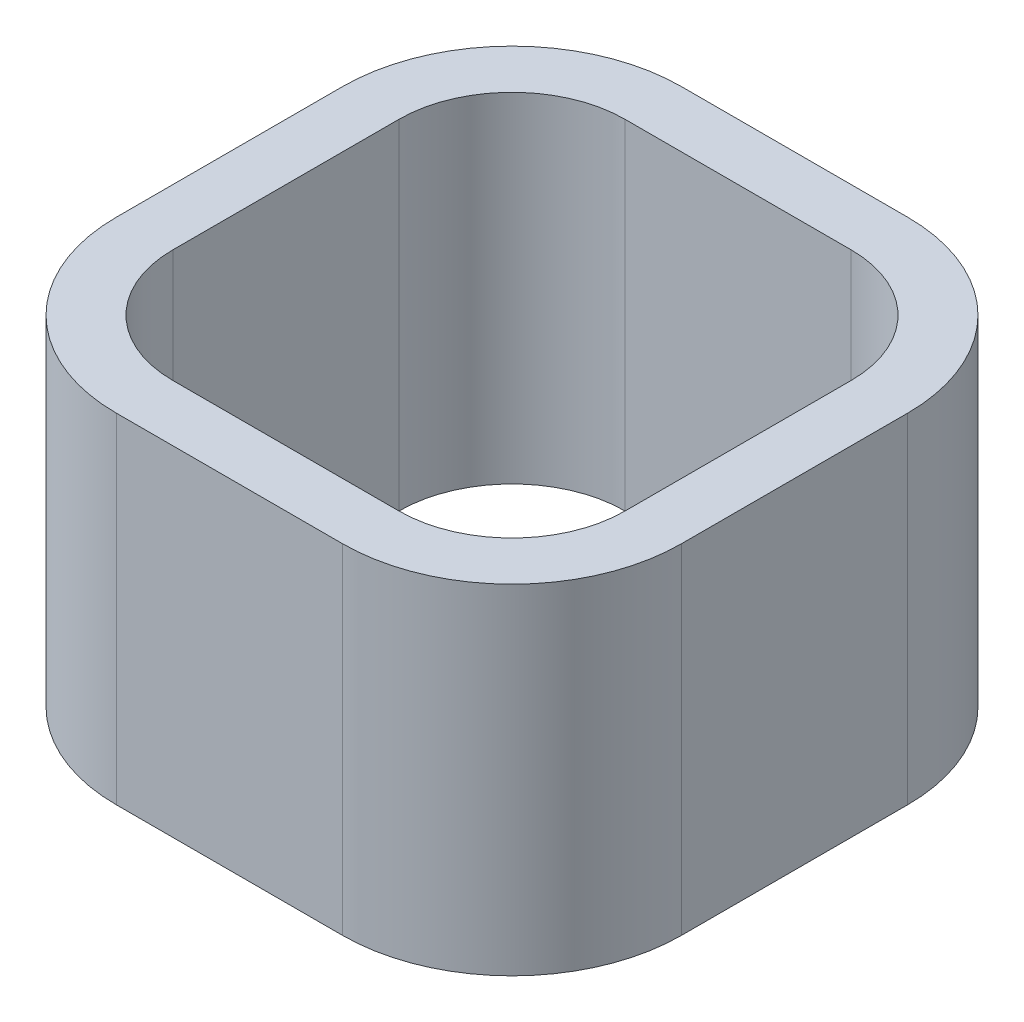
ISO-10303-21;
HEADER;
FILE_DESCRIPTION(('STEP AP214'),'2;1');
FILE_NAME('part.step','',(''),(''),'','','');
FILE_SCHEMA(('AUTOMOTIVE_DESIGN { 1 0 10303 214 1 1 1 1 }'));
ENDSEC;
DATA;
#1=APPLICATION_CONTEXT('core data for automotive mechanical design processes');
#2=APPLICATION_PROTOCOL_DEFINITION('international standard','automotive_design',2000,#1);
#3=PRODUCT_CONTEXT('',#1,'mechanical');
#4=PRODUCT('Part','Part','',(#3));
#5=PRODUCT_RELATED_PRODUCT_CATEGORY('part','',(#4));
#6=PRODUCT_DEFINITION_FORMATION('','',#4);
#7=PRODUCT_DEFINITION_CONTEXT('part definition',#1,'design');
#8=PRODUCT_DEFINITION('design','',#6,#7);
#9=PRODUCT_DEFINITION_SHAPE('','',#8);
#10=(LENGTH_UNIT() NAMED_UNIT(*) SI_UNIT(.MILLI.,.METRE.));
#11=(NAMED_UNIT(*) PLANE_ANGLE_UNIT() SI_UNIT($,.RADIAN.));
#12=(NAMED_UNIT(*) SI_UNIT($,.STERADIAN.) SOLID_ANGLE_UNIT());
#13=UNCERTAINTY_MEASURE_WITH_UNIT(LENGTH_MEASURE(1.E-05),#10,'distance_accuracy_value','');
#14=(GEOMETRIC_REPRESENTATION_CONTEXT(3) GLOBAL_UNCERTAINTY_ASSIGNED_CONTEXT((#13)) GLOBAL_UNIT_ASSIGNED_CONTEXT((#10,
#11,#12)) REPRESENTATION_CONTEXT('',''));
#15=CARTESIAN_POINT('',(0.,0.,0.));
#16=DIRECTION('',(0.,0.,1.));
#17=DIRECTION('',(1.,0.,0.));
#18=AXIS2_PLACEMENT_3D('',#15,#16,#17);
#19=CARTESIAN_POINT('',(0.,3.,0.));
#20=DIRECTION('',(0.,1.,0.));
#21=DIRECTION('',(0.,0.,1.));
#22=AXIS2_PLACEMENT_3D('',#19,#20,#21);
#23=PLANE('',#22);
#24=DIRECTION('',(1.,0.,0.));
#25=VECTOR('',#24,1.);
#26=CARTESIAN_POINT('',(-2.5,3.,2.5));
#27=LINE('',#26,#25);
#28=CARTESIAN_POINT('',(-1.,3.,2.5));
#29=VERTEX_POINT('',#28);
#30=CARTESIAN_POINT('',(1.,3.,2.5));
#31=VERTEX_POINT('',#30);
#32=EDGE_CURVE('E200',#29,#31,#27,.T.);
#33=ORIENTED_EDGE('',*,*,#32,.T.);
#34=CARTESIAN_POINT('',(1.,3.,1.));
#35=DIRECTION('',(0.,1.,0.));
#36=DIRECTION('',(0.,0.,1.));
#37=AXIS2_PLACEMENT_3D('',#34,#35,#36);
#38=CIRCLE('',#37,1.5);
#39=CARTESIAN_POINT('',(2.5,3.,1.));
#40=VERTEX_POINT('',#39);
#41=EDGE_CURVE('E271',#31,#40,#38,.T.);
#42=ORIENTED_EDGE('',*,*,#41,.T.);
#43=DIRECTION('',(0.,0.,-1.));
#44=VECTOR('',#43,1.);
#45=CARTESIAN_POINT('',(2.5,3.,-2.5));
#46=LINE('',#45,#44);
#47=CARTESIAN_POINT('',(2.5,3.,-0.999999999999999));
#48=VERTEX_POINT('',#47);
#49=EDGE_CURVE('E192',#40,#48,#46,.T.);
#50=ORIENTED_EDGE('',*,*,#49,.T.);
#51=CARTESIAN_POINT('',(1.,3.,-0.999999999999999));
#52=DIRECTION('',(0.,1.,0.));
#53=DIRECTION('',(0.,0.,1.));
#54=AXIS2_PLACEMENT_3D('',#51,#52,#53);
#55=CIRCLE('',#54,1.5);
#56=CARTESIAN_POINT('',(1.,3.,-2.5));
#57=VERTEX_POINT('',#56);
#58=EDGE_CURVE('E266',#48,#57,#55,.T.);
#59=ORIENTED_EDGE('',*,*,#58,.T.);
#60=DIRECTION('',(-1.,0.,0.));
#61=VECTOR('',#60,1.);
#62=CARTESIAN_POINT('',(-2.5,3.,-2.5));
#63=LINE('',#62,#61);
#64=CARTESIAN_POINT('',(-1.,3.,-2.5));
#65=VERTEX_POINT('',#64);
#66=EDGE_CURVE('E195',#57,#65,#63,.T.);
#67=ORIENTED_EDGE('',*,*,#66,.T.);
#68=CARTESIAN_POINT('',(-1.,3.,-0.999999999999999));
#69=DIRECTION('',(0.,1.,0.));
#70=DIRECTION('',(0.,0.,1.));
#71=AXIS2_PLACEMENT_3D('',#68,#69,#70);
#72=CIRCLE('',#71,1.5);
#73=CARTESIAN_POINT('',(-2.5,3.,-0.999999999999999));
#74=VERTEX_POINT('',#73);
#75=EDGE_CURVE('E62',#65,#74,#72,.T.);
#76=ORIENTED_EDGE('',*,*,#75,.T.);
#77=DIRECTION('',(0.,0.,1.));
#78=VECTOR('',#77,1.);
#79=CARTESIAN_POINT('',(-2.5,3.,-2.5));
#80=LINE('',#79,#78);
#81=CARTESIAN_POINT('',(-2.5,3.,1.));
#82=VERTEX_POINT('',#81);
#83=EDGE_CURVE('E198',#74,#82,#80,.T.);
#84=ORIENTED_EDGE('',*,*,#83,.T.);
#85=CARTESIAN_POINT('',(-1.,3.,1.));
#86=DIRECTION('',(0.,1.,0.));
#87=DIRECTION('',(0.,0.,1.));
#88=AXIS2_PLACEMENT_3D('',#85,#86,#87);
#89=CIRCLE('',#88,1.5);
#90=EDGE_CURVE('E269',#82,#29,#89,.T.);
#91=ORIENTED_EDGE('',*,*,#90,.T.);
#92=EDGE_LOOP('',(#33,#42,#50,#59,#67,#76,#84,#91));
#93=FACE_BOUND('',#92,.T.);
#94=DIRECTION('',(-1.,0.,0.));
#95=VECTOR('',#94,1.);
#96=CARTESIAN_POINT('',(-2.,3.,-2.));
#97=LINE('',#96,#95);
#98=CARTESIAN_POINT('',(1.,3.,-2.));
#99=VERTEX_POINT('',#98);
#100=CARTESIAN_POINT('',(-1.,3.,-2.));
#101=VERTEX_POINT('',#100);
#102=EDGE_CURVE('E174',#99,#101,#97,.T.);
#103=ORIENTED_EDGE('',*,*,#102,.F.);
#104=CARTESIAN_POINT('',(1.,3.,-1.));
#105=DIRECTION('',(0.,1.,0.));
#106=DIRECTION('',(0.,0.,1.));
#107=AXIS2_PLACEMENT_3D('',#104,#105,#106);
#108=CIRCLE('',#107,1.);
#109=CARTESIAN_POINT('',(2.,3.,-1.));
#110=VERTEX_POINT('',#109);
#111=EDGE_CURVE('E242',#99,#110,#108,.F.);
#112=ORIENTED_EDGE('',*,*,#111,.T.);
#113=DIRECTION('',(0.,0.,-1.));
#114=VECTOR('',#113,1.);
#115=CARTESIAN_POINT('',(2.,3.,-2.));
#116=LINE('',#115,#114);
#117=CARTESIAN_POINT('',(2.,3.,1.));
#118=VERTEX_POINT('',#117);
#119=EDGE_CURVE('E171',#118,#110,#116,.T.);
#120=ORIENTED_EDGE('',*,*,#119,.F.);
#121=CARTESIAN_POINT('',(1.,3.,1.));
#122=DIRECTION('',(0.,1.,0.));
#123=DIRECTION('',(0.,0.,1.));
#124=AXIS2_PLACEMENT_3D('',#121,#122,#123);
#125=CIRCLE('',#124,1.);
#126=CARTESIAN_POINT('',(1.,3.,2.));
#127=VERTEX_POINT('',#126);
#128=EDGE_CURVE('E238',#118,#127,#125,.F.);
#129=ORIENTED_EDGE('',*,*,#128,.T.);
#130=DIRECTION('',(1.,0.,0.));
#131=VECTOR('',#130,1.);
#132=CARTESIAN_POINT('',(-2.,3.,2.));
#133=LINE('',#132,#131);
#134=CARTESIAN_POINT('',(-0.999999999999999,3.,2.));
#135=VERTEX_POINT('',#134);
#136=EDGE_CURVE('E181',#135,#127,#133,.T.);
#137=ORIENTED_EDGE('',*,*,#136,.F.);
#138=CARTESIAN_POINT('',(-0.999999999999999,3.,1.));
#139=DIRECTION('',(0.,1.,0.));
#140=DIRECTION('',(0.,0.,1.));
#141=AXIS2_PLACEMENT_3D('',#138,#139,#140);
#142=CIRCLE('',#141,1.);
#143=CARTESIAN_POINT('',(-2.,3.,1.));
#144=VERTEX_POINT('',#143);
#145=EDGE_CURVE('E234',#135,#144,#142,.F.);
#146=ORIENTED_EDGE('',*,*,#145,.T.);
#147=DIRECTION('',(0.,0.,1.));
#148=VECTOR('',#147,1.);
#149=CARTESIAN_POINT('',(-2.,3.,-2.));
#150=LINE('',#149,#148);
#151=CARTESIAN_POINT('',(-2.,3.,-0.999999999999999));
#152=VERTEX_POINT('',#151);
#153=EDGE_CURVE('E178',#152,#144,#150,.T.);
#154=ORIENTED_EDGE('',*,*,#153,.F.);
#155=CARTESIAN_POINT('',(-1.,3.,-1.));
#156=DIRECTION('',(0.,1.,0.));
#157=DIRECTION('',(0.,0.,1.));
#158=AXIS2_PLACEMENT_3D('',#155,#156,#157);
#159=CIRCLE('',#158,1.);
#160=EDGE_CURVE('E246',#152,#101,#159,.F.);
#161=ORIENTED_EDGE('',*,*,#160,.T.);
#162=EDGE_LOOP('',(#103,#112,#120,#129,#137,#146,#154,#161));
#163=FACE_BOUND('',#162,.T.);
#164=ADVANCED_FACE('F36',(#93,#163),#23,.T.);
#165=CARTESIAN_POINT('',(0.,0.,0.));
#166=DIRECTION('',(0.,1.,0.));
#167=DIRECTION('',(0.,0.,1.));
#168=AXIS2_PLACEMENT_3D('',#165,#166,#167);
#169=PLANE('',#168);
#170=DIRECTION('',(0.,0.,-1.));
#171=VECTOR('',#170,1.);
#172=CARTESIAN_POINT('',(2.5,0.,-2.5));
#173=LINE('',#172,#171);
#174=CARTESIAN_POINT('',(2.5,0.,1.));
#175=VERTEX_POINT('',#174);
#176=CARTESIAN_POINT('',(2.5,0.,-0.999999999999999));
#177=VERTEX_POINT('',#176);
#178=EDGE_CURVE('E183',#175,#177,#173,.T.);
#179=ORIENTED_EDGE('',*,*,#178,.F.);
#180=CARTESIAN_POINT('',(1.,0.,1.));
#181=DIRECTION('',(0.,1.,0.));
#182=DIRECTION('',(0.,0.,1.));
#183=AXIS2_PLACEMENT_3D('',#180,#181,#182);
#184=CIRCLE('',#183,1.5);
#185=CARTESIAN_POINT('',(1.,0.,2.5));
#186=VERTEX_POINT('',#185);
#187=EDGE_CURVE('E259',#175,#186,#184,.F.);
#188=ORIENTED_EDGE('',*,*,#187,.T.);
#189=DIRECTION('',(1.,0.,0.));
#190=VECTOR('',#189,1.);
#191=CARTESIAN_POINT('',(-2.5,0.,2.5));
#192=LINE('',#191,#190);
#193=CARTESIAN_POINT('',(-1.,0.,2.5));
#194=VERTEX_POINT('',#193);
#195=EDGE_CURVE('E196',#194,#186,#192,.T.);
#196=ORIENTED_EDGE('',*,*,#195,.F.);
#197=CARTESIAN_POINT('',(-1.,0.,1.));
#198=DIRECTION('',(0.,1.,0.));
#199=DIRECTION('',(0.,0.,1.));
#200=AXIS2_PLACEMENT_3D('',#197,#198,#199);
#201=CIRCLE('',#200,1.5);
#202=CARTESIAN_POINT('',(-2.5,0.,1.));
#203=VERTEX_POINT('',#202);
#204=EDGE_CURVE('E257',#194,#203,#201,.F.);
#205=ORIENTED_EDGE('',*,*,#204,.T.);
#206=DIRECTION('',(0.,0.,1.));
#207=VECTOR('',#206,1.);
#208=CARTESIAN_POINT('',(-2.5,0.,-2.5));
#209=LINE('',#208,#207);
#210=CARTESIAN_POINT('',(-2.5,0.,-0.999999999999999));
#211=VERTEX_POINT('',#210);
#212=EDGE_CURVE('E209',#211,#203,#209,.T.);
#213=ORIENTED_EDGE('',*,*,#212,.F.);
#214=CARTESIAN_POINT('',(-1.,0.,-0.999999999999999));
#215=DIRECTION('',(0.,1.,0.));
#216=DIRECTION('',(0.,0.,1.));
#217=AXIS2_PLACEMENT_3D('',#214,#215,#216);
#218=CIRCLE('',#217,1.5);
#219=CARTESIAN_POINT('',(-1.,0.,-2.5));
#220=VERTEX_POINT('',#219);
#221=EDGE_CURVE('E255',#211,#220,#218,.F.);
#222=ORIENTED_EDGE('',*,*,#221,.T.);
#223=DIRECTION('',(-1.,0.,0.));
#224=VECTOR('',#223,1.);
#225=CARTESIAN_POINT('',(-2.5,0.,-2.5));
#226=LINE('',#225,#224);
#227=CARTESIAN_POINT('',(1.,0.,-2.5));
#228=VERTEX_POINT('',#227);
#229=EDGE_CURVE('E206',#228,#220,#226,.T.);
#230=ORIENTED_EDGE('',*,*,#229,.F.);
#231=CARTESIAN_POINT('',(1.,0.,-0.999999999999999));
#232=DIRECTION('',(0.,1.,0.));
#233=DIRECTION('',(0.,0.,1.));
#234=AXIS2_PLACEMENT_3D('',#231,#232,#233);
#235=CIRCLE('',#234,1.5);
#236=EDGE_CURVE('E253',#228,#177,#235,.F.);
#237=ORIENTED_EDGE('',*,*,#236,.T.);
#238=EDGE_LOOP('',(#179,#188,#196,#205,#213,#222,#230,#237));
#239=FACE_BOUND('',#238,.T.);
#240=DIRECTION('',(1.,0.,0.));
#241=VECTOR('',#240,1.);
#242=CARTESIAN_POINT('',(-2.,0.,2.));
#243=LINE('',#242,#241);
#244=CARTESIAN_POINT('',(-0.999999999999999,0.,2.));
#245=VERTEX_POINT('',#244);
#246=CARTESIAN_POINT('',(1.,0.,2.));
#247=VERTEX_POINT('',#246);
#248=EDGE_CURVE('E175',#245,#247,#243,.T.);
#249=ORIENTED_EDGE('',*,*,#248,.T.);
#250=CARTESIAN_POINT('',(1.,0.,1.));
#251=DIRECTION('',(0.,1.,0.));
#252=DIRECTION('',(0.,0.,1.));
#253=AXIS2_PLACEMENT_3D('',#250,#251,#252);
#254=CIRCLE('',#253,1.);
#255=CARTESIAN_POINT('',(2.,0.,1.));
#256=VERTEX_POINT('',#255);
#257=EDGE_CURVE('E236',#247,#256,#254,.T.);
#258=ORIENTED_EDGE('',*,*,#257,.T.);
#259=DIRECTION('',(0.,0.,-1.));
#260=VECTOR('',#259,1.);
#261=CARTESIAN_POINT('',(2.,0.,-2.));
#262=LINE('',#261,#260);
#263=CARTESIAN_POINT('',(2.,0.,-1.));
#264=VERTEX_POINT('',#263);
#265=EDGE_CURVE('E165',#256,#264,#262,.T.);
#266=ORIENTED_EDGE('',*,*,#265,.T.);
#267=CARTESIAN_POINT('',(1.,0.,-1.));
#268=DIRECTION('',(0.,1.,0.));
#269=DIRECTION('',(0.,0.,1.));
#270=AXIS2_PLACEMENT_3D('',#267,#268,#269);
#271=CIRCLE('',#270,1.);
#272=CARTESIAN_POINT('',(1.,0.,-2.));
#273=VERTEX_POINT('',#272);
#274=EDGE_CURVE('E240',#264,#273,#271,.T.);
#275=ORIENTED_EDGE('',*,*,#274,.T.);
#276=DIRECTION('',(-1.,0.,0.));
#277=VECTOR('',#276,1.);
#278=CARTESIAN_POINT('',(-2.,0.,-2.));
#279=LINE('',#278,#277);
#280=CARTESIAN_POINT('',(-1.,0.,-2.));
#281=VERTEX_POINT('',#280);
#282=EDGE_CURVE('E168',#273,#281,#279,.T.);
#283=ORIENTED_EDGE('',*,*,#282,.T.);
#284=CARTESIAN_POINT('',(-1.,0.,-1.));
#285=DIRECTION('',(0.,1.,0.));
#286=DIRECTION('',(0.,0.,1.));
#287=AXIS2_PLACEMENT_3D('',#284,#285,#286);
#288=CIRCLE('',#287,1.);
#289=CARTESIAN_POINT('',(-2.,0.,-0.999999999999999));
#290=VERTEX_POINT('',#289);
#291=EDGE_CURVE('E244',#281,#290,#288,.T.);
#292=ORIENTED_EDGE('',*,*,#291,.T.);
#293=DIRECTION('',(0.,0.,1.));
#294=VECTOR('',#293,1.);
#295=CARTESIAN_POINT('',(-2.,0.,-2.));
#296=LINE('',#295,#294);
#297=CARTESIAN_POINT('',(-2.,0.,1.));
#298=VERTEX_POINT('',#297);
#299=EDGE_CURVE('E187',#290,#298,#296,.T.);
#300=ORIENTED_EDGE('',*,*,#299,.T.);
#301=CARTESIAN_POINT('',(-0.999999999999999,0.,1.));
#302=DIRECTION('',(0.,1.,0.));
#303=DIRECTION('',(0.,0.,1.));
#304=AXIS2_PLACEMENT_3D('',#301,#302,#303);
#305=CIRCLE('',#304,1.);
#306=EDGE_CURVE('E232',#298,#245,#305,.T.);
#307=ORIENTED_EDGE('',*,*,#306,.T.);
#308=EDGE_LOOP('',(#249,#258,#266,#275,#283,#292,#300,#307));
#309=FACE_BOUND('',#308,.T.);
#310=ADVANCED_FACE('F294',(#239,#309),#169,.F.);
#311=CARTESIAN_POINT('',(2.5,3.,-2.5));
#312=DIRECTION('',(-1.,0.,0.));
#313=DIRECTION('',(0.,0.,1.));
#314=AXIS2_PLACEMENT_3D('',#311,#312,#313);
#315=PLANE('',#314);
#316=ORIENTED_EDGE('',*,*,#49,.F.);
#317=DIRECTION('',(0.,-1.,0.));
#318=VECTOR('',#317,1.);
#319=CARTESIAN_POINT('',(2.5,3.,1.));
#320=LINE('',#319,#318);
#321=EDGE_CURVE('E250',#40,#175,#320,.T.);
#322=ORIENTED_EDGE('',*,*,#321,.T.);
#323=ORIENTED_EDGE('',*,*,#178,.T.);
#324=DIRECTION('',(0.,-1.,0.));
#325=VECTOR('',#324,1.);
#326=CARTESIAN_POINT('',(2.5,3.,-0.999999999999999));
#327=LINE('',#326,#325);
#328=EDGE_CURVE('E248',#177,#48,#327,.F.);
#329=ORIENTED_EDGE('',*,*,#328,.T.);
#330=EDGE_LOOP('',(#316,#322,#323,#329));
#331=FACE_BOUND('',#330,.T.);
#332=ADVANCED_FACE('F311',(#331),#315,.F.);
#333=CARTESIAN_POINT('',(-2.5,3.,-2.5));
#334=DIRECTION('',(0.,0.,1.));
#335=DIRECTION('',(1.,0.,0.));
#336=AXIS2_PLACEMENT_3D('',#333,#334,#335);
#337=PLANE('',#336);
#338=ORIENTED_EDGE('',*,*,#229,.T.);
#339=DIRECTION('',(0.,-1.,0.));
#340=VECTOR('',#339,1.);
#341=CARTESIAN_POINT('',(-1.,3.,-2.5));
#342=LINE('',#341,#340);
#343=EDGE_CURVE('E48',#220,#65,#342,.F.);
#344=ORIENTED_EDGE('',*,*,#343,.T.);
#345=ORIENTED_EDGE('',*,*,#66,.F.);
#346=DIRECTION('',(0.,-1.,0.));
#347=VECTOR('',#346,1.);
#348=CARTESIAN_POINT('',(1.,3.,-2.5));
#349=LINE('',#348,#347);
#350=EDGE_CURVE('E277',#57,#228,#349,.T.);
#351=ORIENTED_EDGE('',*,*,#350,.T.);
#352=EDGE_LOOP('',(#338,#344,#345,#351));
#353=FACE_BOUND('',#352,.T.);
#354=ADVANCED_FACE('F282',(#353),#337,.F.);
#355=CARTESIAN_POINT('',(-2.5,3.,-2.5));
#356=DIRECTION('',(1.,0.,0.));
#357=DIRECTION('',(0.,0.,-1.));
#358=AXIS2_PLACEMENT_3D('',#355,#356,#357);
#359=PLANE('',#358);
#360=ORIENTED_EDGE('',*,*,#212,.T.);
#361=DIRECTION('',(0.,-1.,0.));
#362=VECTOR('',#361,1.);
#363=CARTESIAN_POINT('',(-2.5,3.,1.));
#364=LINE('',#363,#362);
#365=EDGE_CURVE('E55',#203,#82,#364,.F.);
#366=ORIENTED_EDGE('',*,*,#365,.T.);
#367=ORIENTED_EDGE('',*,*,#83,.F.);
#368=DIRECTION('',(0.,-1.,0.));
#369=VECTOR('',#368,1.);
#370=CARTESIAN_POINT('',(-2.5,3.,-0.999999999999999));
#371=LINE('',#370,#369);
#372=EDGE_CURVE('E273',#74,#211,#371,.T.);
#373=ORIENTED_EDGE('',*,*,#372,.T.);
#374=EDGE_LOOP('',(#360,#366,#367,#373));
#375=FACE_BOUND('',#374,.T.);
#376=ADVANCED_FACE('F291',(#375),#359,.F.);
#377=CARTESIAN_POINT('',(-2.5,3.,2.5));
#378=DIRECTION('',(0.,0.,-1.));
#379=DIRECTION('',(-1.,0.,0.));
#380=AXIS2_PLACEMENT_3D('',#377,#378,#379);
#381=PLANE('',#380);
#382=ORIENTED_EDGE('',*,*,#195,.T.);
#383=DIRECTION('',(0.,-1.,0.));
#384=VECTOR('',#383,1.);
#385=CARTESIAN_POINT('',(1.,3.,2.5));
#386=LINE('',#385,#384);
#387=EDGE_CURVE('E264',#186,#31,#386,.F.);
#388=ORIENTED_EDGE('',*,*,#387,.T.);
#389=ORIENTED_EDGE('',*,*,#32,.F.);
#390=DIRECTION('',(0.,-1.,0.));
#391=VECTOR('',#390,1.);
#392=CARTESIAN_POINT('',(-1.,3.,2.5));
#393=LINE('',#392,#391);
#394=EDGE_CURVE('E261',#29,#194,#393,.T.);
#395=ORIENTED_EDGE('',*,*,#394,.T.);
#396=EDGE_LOOP('',(#382,#388,#389,#395));
#397=FACE_BOUND('',#396,.T.);
#398=ADVANCED_FACE('F303',(#397),#381,.F.);
#399=CARTESIAN_POINT('',(2.,3.,-2.));
#400=DIRECTION('',(-1.,0.,0.));
#401=DIRECTION('',(0.,0.,1.));
#402=AXIS2_PLACEMENT_3D('',#399,#400,#401);
#403=PLANE('',#402);
#404=ORIENTED_EDGE('',*,*,#265,.F.);
#405=DIRECTION('',(0.,-1.,0.));
#406=VECTOR('',#405,1.);
#407=CARTESIAN_POINT('',(2.,3.,1.));
#408=LINE('',#407,#406);
#409=EDGE_CURVE('E225',#256,#118,#408,.F.);
#410=ORIENTED_EDGE('',*,*,#409,.T.);
#411=ORIENTED_EDGE('',*,*,#119,.T.);
#412=DIRECTION('',(0.,-1.,0.));
#413=VECTOR('',#412,1.);
#414=CARTESIAN_POINT('',(2.,0.,-1.));
#415=LINE('',#414,#413);
#416=EDGE_CURVE('E222',#110,#264,#415,.T.);
#417=ORIENTED_EDGE('',*,*,#416,.T.);
#418=EDGE_LOOP('',(#404,#410,#411,#417));
#419=FACE_BOUND('',#418,.T.);
#420=ADVANCED_FACE('F326',(#419),#403,.T.);
#421=CARTESIAN_POINT('',(-2.,3.,-2.));
#422=DIRECTION('',(0.,0.,1.));
#423=DIRECTION('',(1.,0.,0.));
#424=AXIS2_PLACEMENT_3D('',#421,#422,#423);
#425=PLANE('',#424);
#426=ORIENTED_EDGE('',*,*,#282,.F.);
#427=DIRECTION('',(0.,-1.,0.));
#428=VECTOR('',#427,1.);
#429=CARTESIAN_POINT('',(1.,3.,-2.));
#430=LINE('',#429,#428);
#431=EDGE_CURVE('E230',#273,#99,#430,.F.);
#432=ORIENTED_EDGE('',*,*,#431,.T.);
#433=ORIENTED_EDGE('',*,*,#102,.T.);
#434=DIRECTION('',(0.,-1.,0.));
#435=VECTOR('',#434,1.);
#436=CARTESIAN_POINT('',(-1.,0.,-2.));
#437=LINE('',#436,#435);
#438=EDGE_CURVE('E227',#101,#281,#437,.T.);
#439=ORIENTED_EDGE('',*,*,#438,.T.);
#440=EDGE_LOOP('',(#426,#432,#433,#439));
#441=FACE_BOUND('',#440,.T.);
#442=ADVANCED_FACE('F393',(#441),#425,.T.);
#443=CARTESIAN_POINT('',(-2.,3.,-2.));
#444=DIRECTION('',(1.,0.,0.));
#445=DIRECTION('',(0.,0.,-1.));
#446=AXIS2_PLACEMENT_3D('',#443,#444,#445);
#447=PLANE('',#446);
#448=ORIENTED_EDGE('',*,*,#153,.T.);
#449=DIRECTION('',(0.,-1.,0.));
#450=VECTOR('',#449,1.);
#451=CARTESIAN_POINT('',(-2.,0.,1.));
#452=LINE('',#451,#450);
#453=EDGE_CURVE('E214',#144,#298,#452,.T.);
#454=ORIENTED_EDGE('',*,*,#453,.T.);
#455=ORIENTED_EDGE('',*,*,#299,.F.);
#456=DIRECTION('',(0.,-1.,0.));
#457=VECTOR('',#456,1.);
#458=CARTESIAN_POINT('',(-2.,3.,-0.999999999999999));
#459=LINE('',#458,#457);
#460=EDGE_CURVE('E203',#290,#152,#459,.F.);
#461=ORIENTED_EDGE('',*,*,#460,.T.);
#462=EDGE_LOOP('',(#448,#454,#455,#461));
#463=FACE_BOUND('',#462,.T.);
#464=ADVANCED_FACE('F390',(#463),#447,.T.);
#465=CARTESIAN_POINT('',(-2.,3.,2.));
#466=DIRECTION('',(0.,0.,-1.));
#467=DIRECTION('',(-1.,0.,0.));
#468=AXIS2_PLACEMENT_3D('',#465,#466,#467);
#469=PLANE('',#468);
#470=ORIENTED_EDGE('',*,*,#248,.F.);
#471=DIRECTION('',(0.,-1.,0.));
#472=VECTOR('',#471,1.);
#473=CARTESIAN_POINT('',(-0.999999999999999,3.,2.));
#474=LINE('',#473,#472);
#475=EDGE_CURVE('E220',#245,#135,#474,.F.);
#476=ORIENTED_EDGE('',*,*,#475,.T.);
#477=ORIENTED_EDGE('',*,*,#136,.T.);
#478=DIRECTION('',(0.,-1.,0.));
#479=VECTOR('',#478,1.);
#480=CARTESIAN_POINT('',(1.,0.,2.));
#481=LINE('',#480,#479);
#482=EDGE_CURVE('E217',#127,#247,#481,.T.);
#483=ORIENTED_EDGE('',*,*,#482,.T.);
#484=EDGE_LOOP('',(#470,#476,#477,#483));
#485=FACE_BOUND('',#484,.T.);
#486=ADVANCED_FACE('F341',(#485),#469,.T.);
#487=CARTESIAN_POINT('',(-0.999999999999999,3.,1.));
#488=DIRECTION('',(0.,1.,0.));
#489=DIRECTION('',(0.,0.,1.));
#490=AXIS2_PLACEMENT_3D('',#487,#488,#489);
#491=CYLINDRICAL_SURFACE('',#490,1.);
#492=ORIENTED_EDGE('',*,*,#145,.F.);
#493=ORIENTED_EDGE('',*,*,#475,.F.);
#494=ORIENTED_EDGE('',*,*,#306,.F.);
#495=ORIENTED_EDGE('',*,*,#453,.F.);
#496=EDGE_LOOP('',(#492,#493,#494,#495));
#497=FACE_BOUND('',#496,.T.);
#498=ADVANCED_FACE('F337',(#497),#491,.F.);
#499=CARTESIAN_POINT('',(1.,3.,1.));
#500=DIRECTION('',(0.,1.,0.));
#501=DIRECTION('',(0.,0.,1.));
#502=AXIS2_PLACEMENT_3D('',#499,#500,#501);
#503=CYLINDRICAL_SURFACE('',#502,1.);
#504=ORIENTED_EDGE('',*,*,#128,.F.);
#505=ORIENTED_EDGE('',*,*,#409,.F.);
#506=ORIENTED_EDGE('',*,*,#257,.F.);
#507=ORIENTED_EDGE('',*,*,#482,.F.);
#508=EDGE_LOOP('',(#504,#505,#506,#507));
#509=FACE_BOUND('',#508,.T.);
#510=ADVANCED_FACE('F340',(#509),#503,.F.);
#511=CARTESIAN_POINT('',(1.,3.,-1.));
#512=DIRECTION('',(0.,1.,0.));
#513=DIRECTION('',(0.,0.,1.));
#514=AXIS2_PLACEMENT_3D('',#511,#512,#513);
#515=CYLINDRICAL_SURFACE('',#514,1.);
#516=ORIENTED_EDGE('',*,*,#111,.F.);
#517=ORIENTED_EDGE('',*,*,#431,.F.);
#518=ORIENTED_EDGE('',*,*,#274,.F.);
#519=ORIENTED_EDGE('',*,*,#416,.F.);
#520=EDGE_LOOP('',(#516,#517,#518,#519));
#521=FACE_BOUND('',#520,.T.);
#522=ADVANCED_FACE('F345',(#521),#515,.F.);
#523=CARTESIAN_POINT('',(-1.,3.,-1.));
#524=DIRECTION('',(0.,1.,0.));
#525=DIRECTION('',(0.,0.,1.));
#526=AXIS2_PLACEMENT_3D('',#523,#524,#525);
#527=CYLINDRICAL_SURFACE('',#526,1.);
#528=ORIENTED_EDGE('',*,*,#160,.F.);
#529=ORIENTED_EDGE('',*,*,#460,.F.);
#530=ORIENTED_EDGE('',*,*,#291,.F.);
#531=ORIENTED_EDGE('',*,*,#438,.F.);
#532=EDGE_LOOP('',(#528,#529,#530,#531));
#533=FACE_BOUND('',#532,.T.);
#534=ADVANCED_FACE('F349',(#533),#527,.F.);
#535=CARTESIAN_POINT('',(1.,3.,1.));
#536=DIRECTION('',(0.,-1.,0.));
#537=DIRECTION('',(0.,0.,-1.));
#538=AXIS2_PLACEMENT_3D('',#535,#536,#537);
#539=CYLINDRICAL_SURFACE('',#538,1.5);
#540=ORIENTED_EDGE('',*,*,#41,.F.);
#541=ORIENTED_EDGE('',*,*,#387,.F.);
#542=ORIENTED_EDGE('',*,*,#187,.F.);
#543=ORIENTED_EDGE('',*,*,#321,.F.);
#544=EDGE_LOOP('',(#540,#541,#542,#543));
#545=FACE_BOUND('',#544,.T.);
#546=ADVANCED_FACE('F309',(#545),#539,.T.);
#547=CARTESIAN_POINT('',(-1.,3.,1.));
#548=DIRECTION('',(0.,-1.,0.));
#549=DIRECTION('',(0.,0.,-1.));
#550=AXIS2_PLACEMENT_3D('',#547,#548,#549);
#551=CYLINDRICAL_SURFACE('',#550,1.5);
#552=ORIENTED_EDGE('',*,*,#90,.F.);
#553=ORIENTED_EDGE('',*,*,#365,.F.);
#554=ORIENTED_EDGE('',*,*,#204,.F.);
#555=ORIENTED_EDGE('',*,*,#394,.F.);
#556=EDGE_LOOP('',(#552,#553,#554,#555));
#557=FACE_BOUND('',#556,.T.);
#558=ADVANCED_FACE('F300',(#557),#551,.T.);
#559=CARTESIAN_POINT('',(-1.,3.,-0.999999999999999));
#560=DIRECTION('',(0.,-1.,0.));
#561=DIRECTION('',(0.,0.,-1.));
#562=AXIS2_PLACEMENT_3D('',#559,#560,#561);
#563=CYLINDRICAL_SURFACE('',#562,1.5);
#564=CARTESIAN_POINT('',(-2.16140956313826,1.5,-1.94927752878229));
#565=CARTESIAN_POINT('',(-2.16140937543284,1.50840293462604,-1.94927785583784));
#566=CARTESIAN_POINT('',(-2.16095931903215,1.51681142526177,-1.94982921418878));
#567=CARTESIAN_POINT('',(-2.15916656590459,1.53339527794403,-1.952016173472));
#568=CARTESIAN_POINT('',(-2.15782288544679,1.54157037270562,-1.95365296928404));
#569=CARTESIAN_POINT('',(-2.15426994932946,1.55744487288268,-1.95795021219244));
#570=CARTESIAN_POINT('',(-2.15206121841338,1.56514456340871,-1.96061003869633));
#571=CARTESIAN_POINT('',(-2.14682290858877,1.57985516884376,-1.96685767067218));
#572=CARTESIAN_POINT('',(-2.14379349270704,1.58686622017255,-1.97044529183389));
#573=CARTESIAN_POINT('',(-2.13696449188801,1.60002768954862,-1.97843721244132));
#574=CARTESIAN_POINT('',(-2.13316244827623,1.60617525142556,-1.98284411511319));
#575=CARTESIAN_POINT('',(-2.12487537772024,1.61741064135053,-1.99231794821764));
#576=CARTESIAN_POINT('',(-2.1203903195427,1.62249842091094,-1.99738490883225));
#577=CARTESIAN_POINT('',(-2.11082835773754,1.63147968855106,-2.00802358173797));
#578=CARTESIAN_POINT('',(-2.10575023272819,1.63537064981904,-2.01359633021562));
#579=CARTESIAN_POINT('',(-2.09513249212371,1.64183166497229,-2.02505892054801));
#580=CARTESIAN_POINT('',(-2.08959288778148,1.64440175105541,-2.03094875466956));
#581=CARTESIAN_POINT('',(-2.0782145694525,1.64813968640298,-2.04284265947098));
#582=CARTESIAN_POINT('',(-2.07237692465212,1.64931222491248,-2.04884627907291));
#583=CARTESIAN_POINT('',(-2.06054524026621,1.65023629037005,-2.06080844111264));
#584=CARTESIAN_POINT('',(-2.05455120473969,1.64998785416193,-2.06676698471518));
#585=CARTESIAN_POINT('',(-2.04260114567344,1.64808082910247,-2.0784490929483));
#586=CARTESIAN_POINT('',(-2.03664506284135,1.64642728266541,-2.08417342119457));
#587=CARTESIAN_POINT('',(-2.02492739112153,1.641764830658,-2.0952574717385));
#588=CARTESIAN_POINT('',(-2.01916580476128,1.63875590748185,-2.10061718929898));
#589=CARTESIAN_POINT('',(-2.00800571918704,1.63146258551182,-2.1108473961964));
#590=CARTESIAN_POINT('',(-2.00260787558997,1.62717595537047,-2.11571700956407));
#591=CARTESIAN_POINT('',(-1.9923589952341,1.61745052149954,-2.12484255990719));
#592=CARTESIAN_POINT('',(-1.98750797451883,1.61201168397821,-2.12909847887815));
#593=CARTESIAN_POINT('',(-1.97849296686587,1.60010786557295,-2.13692012207629));
#594=CARTESIAN_POINT('',(-1.97433207939177,1.59363849828876,-2.14048274440361));
#595=CARTESIAN_POINT('',(-1.96686597835634,1.57987247021838,-2.14681918159128));
#596=CARTESIAN_POINT('',(-1.96356076603623,1.57257580823217,-2.14959299530741));
#597=CARTESIAN_POINT('',(-1.95792236945602,1.55735894622003,-2.1542955783976));
#598=CARTESIAN_POINT('',(-1.95558939015209,1.54943861513656,-2.15622416959495));
#599=CARTESIAN_POINT('',(-1.95198156649103,1.53320090930779,-2.15919653634288));
#600=CARTESIAN_POINT('',(-1.95070668989704,1.52488354666688,-2.16024033885004));
#601=CARTESIAN_POINT('',(-1.94926550713434,1.50812637307057,-2.16141976770731));
#602=CARTESIAN_POINT('',(-1.94909443208285,1.49968724696028,-2.16155930088944));
#603=CARTESIAN_POINT('',(-1.94985451684354,1.48289231012657,-2.16093782279094));
#604=CARTESIAN_POINT('',(-1.95078566176233,1.47453649827895,-2.16017682367847));
#605=CARTESIAN_POINT('',(-1.95371256247483,1.45816326265825,-2.15777194928198));
#606=CARTESIAN_POINT('',(-1.95570607571867,1.45014516433581,-2.15612993368323));
#607=CARTESIAN_POINT('',(-1.96068406127221,1.43465399224046,-2.15199676191463));
#608=CARTESIAN_POINT('',(-1.96366855628129,1.42718093095693,-2.14950558629393));
#609=CARTESIAN_POINT('',(-1.97053490564533,1.41296400389569,-2.14371419549455));
#610=CARTESIAN_POINT('',(-1.97441978206852,1.40622270870507,-2.14041125336953));
#611=CARTESIAN_POINT('',(-1.98294748820503,1.3936867420089,-2.13306919944011));
#612=CARTESIAN_POINT('',(-1.9875903366854,1.387892093949,-2.12903006940776));
#613=CARTESIAN_POINT('',(-1.99749686940695,1.3773927549903,-2.12028733464368));
#614=CARTESIAN_POINT('',(-2.00276273005625,1.37269206606208,-2.11558138845114));
#615=CARTESIAN_POINT('',(-2.01372985218846,1.36454161972405,-2.10562496526249));
#616=CARTESIAN_POINT('',(-2.01943110770421,1.36109184517394,-2.10037449572883));
#617=CARTESIAN_POINT('',(-2.03107793296032,1.35554793485171,-2.08946857502943));
#618=CARTESIAN_POINT('',(-2.03702304678796,1.35345138190123,-2.08381386612073));
#619=CARTESIAN_POINT('',(-2.04898528715394,1.35066553956303,-2.07224022196017));
#620=CARTESIAN_POINT('',(-2.05500241166363,1.34997621062491,-2.06632129413904));
#621=CARTESIAN_POINT('',(-2.06690593360554,1.350024939966,-2.05441088498424));
#622=CARTESIAN_POINT('',(-2.07279278675765,1.35075678552551,-2.04841983271134));
#623=CARTESIAN_POINT('',(-2.08429982883682,1.35361406184856,-2.0365145661969));
#624=CARTESIAN_POINT('',(-2.08992001755456,1.35573949370596,-2.03060035201567));
#625=CARTESIAN_POINT('',(-2.1007464596959,1.36132188860895,-2.01902897677457));
#626=CARTESIAN_POINT('',(-2.10595276946148,1.36477867004013,-2.0133717807715));
#627=CARTESIAN_POINT('',(-2.11582539627163,1.37292497533756,-2.0024907597564));
#628=CARTESIAN_POINT('',(-2.12049171647562,1.37761449199068,-1.99726693220883));
#629=CARTESIAN_POINT('',(-2.12919627427978,1.38811644285357,-1.98740028061698));
#630=CARTESIAN_POINT('',(-2.13323179664229,1.39393350243673,-1.98275998423177));
#631=CARTESIAN_POINT('',(-2.14056433411429,1.40651630273182,-1.97424056656163));
#632=CARTESIAN_POINT('',(-2.14386117176274,1.41328227077537,-1.97036162821245));
#633=CARTESIAN_POINT('',(-2.14965385316435,1.42758965128799,-1.96349173512792));
#634=CARTESIAN_POINT('',(-2.15214763840408,1.43513299219861,-1.96050306391445));
#635=CARTESIAN_POINT('',(-2.1562698462703,1.45076224368694,-1.95553678870205));
#636=CARTESIAN_POINT('',(-2.15789924501623,1.45884753058886,-1.95355804432654));
#637=CARTESIAN_POINT('',(-2.15985541943524,1.47248216113487,-1.95117653644896));
#638=CARTESIAN_POINT('',(-2.16043764423348,1.47794433769597,-1.95046559926088));
#639=CARTESIAN_POINT('',(-2.16121477706775,1.48893687345638,-1.94951598874673));
#640=CARTESIAN_POINT('',(-2.16140968672966,1.49446723236939,-1.94927731343819));
#641=CARTESIAN_POINT('',(-2.16140956313826,1.5,-1.94927752878229));
#642=B_SPLINE_CURVE_WITH_KNOTS('',3,(#564,#565,#566,#567,#568,#569,#570,#571,#572,#573,#574,
#575,#576,#577,#578,#579,#580,#581,#582,#583,#584,#585,#586,#587,#588,#589,#590,#591,#592,#593,
#594,#595,#596,#597,#598,#599,#600,#601,#602,#603,#604,#605,#606,#607,#608,#609,#610,#611,#612,
#613,#614,#615,#616,#617,#618,#619,#620,#621,#622,#623,#624,#625,#626,#627,#628,#629,#630,#631,
#632,#633,#634,#635,#636,#637,#638,#639,#640,#641),.UNSPECIFIED.,.T.,.F.,(4,2,2,2,2,2,2,2,2,2,2,
2,2,2,2,2,2,2,2,2,2,2,2,2,2,2,2,2,2,2,2,2,2,2,2,2,2,2,4),(0.,0.0251885991654674,
0.0504049727732615,0.0756060736496151,0.100802172063189,0.126079742294878,0.151358468782868,
0.176690204956924,0.202021323611676,0.227267206347657,0.25251243449733,0.277667447727971,
0.302822787721439,0.328022318199595,0.353222587827766,0.378533137627473,0.403843724141314,
0.429159643676868,0.454474791892515,0.479680494461611,0.504885856450267,0.530038222056749,
0.555191163841528,0.580429784717533,0.605669030584758,0.63099920522713,0.656329032776958,
0.68161348904149,0.70689723466967,0.732070700202669,0.75724418549493,0.782414237992811,
0.807584143216137,0.832859572556919,0.858141067551723,0.883486861605648,0.908803972340933,
0.925389041409,0.941974040855652),.UNSPECIFIED.);
#643=CARTESIAN_POINT('',(-2.16140956313826,1.5,-1.94927752878229));
#644=VERTEX_POINT('',#643);
#645=EDGE_CURVE('E11',#644,#644,#642,.T.);
#646=ORIENTED_EDGE('',*,*,#645,.F.);
#647=EDGE_LOOP('',(#646));
#648=FACE_BOUND('',#647,.T.);
#649=ORIENTED_EDGE('',*,*,#75,.F.);
#650=ORIENTED_EDGE('',*,*,#343,.F.);
#651=ORIENTED_EDGE('',*,*,#221,.F.);
#652=ORIENTED_EDGE('',*,*,#372,.F.);
#653=EDGE_LOOP('',(#649,#650,#651,#652));
#654=FACE_BOUND('',#653,.T.);
#655=ADVANCED_FACE('F289',(#648,#654),#563,.T.);
#656=CARTESIAN_POINT('',(1.,3.,-0.999999999999999));
#657=DIRECTION('',(0.,-1.,0.));
#658=DIRECTION('',(0.,0.,-1.));
#659=AXIS2_PLACEMENT_3D('',#656,#657,#658);
#660=CYLINDRICAL_SURFACE('',#659,1.5);
#661=ORIENTED_EDGE('',*,*,#58,.F.);
#662=ORIENTED_EDGE('',*,*,#328,.F.);
#663=ORIENTED_EDGE('',*,*,#236,.F.);
#664=ORIENTED_EDGE('',*,*,#350,.F.);
#665=EDGE_LOOP('',(#661,#662,#663,#664));
#666=FACE_BOUND('',#665,.T.);
#667=ADVANCED_FACE('F38',(#666),#660,.T.);
#668=CARTESIAN_POINT('',(-2.05358910396797,1.5,-2.05358910396795));
#669=DIRECTION('',(-0.707106781186551,0.,-0.707106781186544));
#670=DIRECTION('',(-0.707106781186544,0.,0.707106781186551));
#671=AXIS2_PLACEMENT_3D('',#668,#669,#670);
#672=CONICAL_SURFACE('',#671,0.149999999999989,0.785398163397454);
#673=CARTESIAN_POINT('',(-1.94752308679,1.5,-1.94752308678998));
#674=VERTEX_POINT('',#673);
#675=VERTEX_LOOP('',#674);
#676=FACE_BOUND('',#675,.T.);
#677=CARTESIAN_POINT('',(-2.05358910396797,1.5,-2.05358910396795));
#678=DIRECTION('',(-0.707106781186551,0.,-0.707106781186544));
#679=DIRECTION('',(-0.707106781186544,0.,0.707106781186551));
#680=AXIS2_PLACEMENT_3D('',#677,#678,#679);
#681=CIRCLE('',#680,0.149999999999989);
#682=CARTESIAN_POINT('',(-2.15965512114594,1.5,-1.94752308678997));
#683=VERTEX_POINT('',#682);
#684=EDGE_CURVE('E163',#683,#683,#681,.T.);
#685=ORIENTED_EDGE('',*,*,#684,.T.);
#686=EDGE_LOOP('',(#685));
#687=FACE_BOUND('',#686,.T.);
#688=ADVANCED_FACE('F156',(#676,#687),#672,.F.);
#689=CARTESIAN_POINT('',(-2.06066017177983,1.5,-2.06066017177981));
#690=DIRECTION('',(-0.707106781186551,0.,-0.707106781186544));
#691=DIRECTION('',(-0.707106781186544,0.,0.707106781186551));
#692=AXIS2_PLACEMENT_3D('',#689,#690,#691);
#693=CYLINDRICAL_SURFACE('',#692,0.149999999999989);
#694=ORIENTED_EDGE('',*,*,#645,.T.);
#695=EDGE_LOOP('',(#694));
#696=FACE_BOUND('',#695,.T.);
#697=ORIENTED_EDGE('',*,*,#684,.F.);
#698=EDGE_LOOP('',(#697));
#699=FACE_BOUND('',#698,.T.);
#700=ADVANCED_FACE('F159',(#696,#699),#693,.F.);
#701=CLOSED_SHELL('',(#164,#310,#332,#354,#376,#398,#420,#442,#464,#486,#498,#510,#522,#534,
#546,#558,#655,#667,#688,#700));
#702=MANIFOLD_SOLID_BREP('B2',#701);
#703=ADVANCED_BREP_SHAPE_REPRESENTATION('',(#18,#702),#14);
#704=SHAPE_DEFINITION_REPRESENTATION(#9,#703);
ENDSEC;
END-ISO-10303-21;
